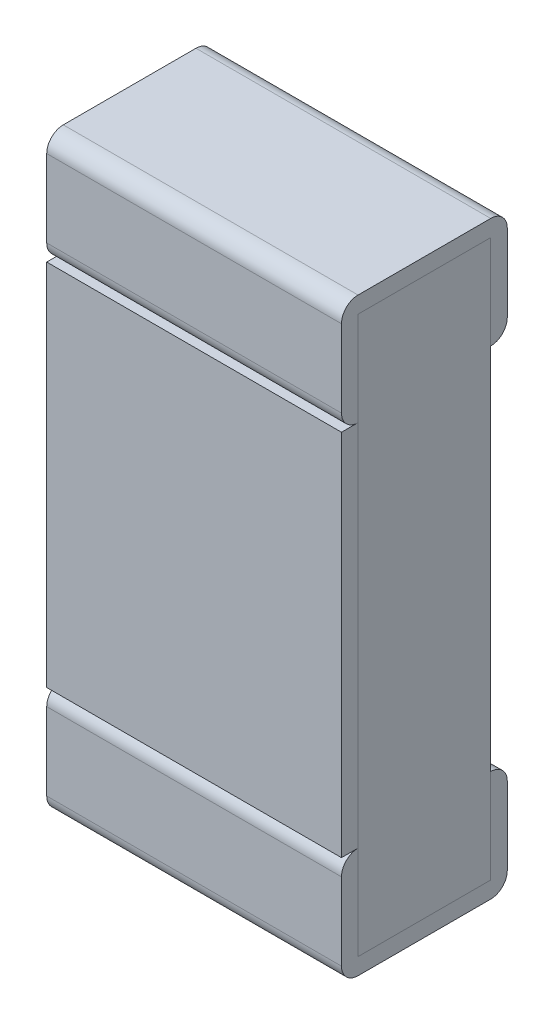
ISO-10303-21;
HEADER;
FILE_DESCRIPTION(('STEP AP214'),'2;1');
FILE_NAME('part.step','',(''),(''),'','','');
FILE_SCHEMA(('AUTOMOTIVE_DESIGN { 1 0 10303 214 1 1 1 1 }'));
ENDSEC;
DATA;
#1=APPLICATION_CONTEXT('core data for automotive mechanical design processes');
#2=APPLICATION_PROTOCOL_DEFINITION('international standard','automotive_design',2000,#1);
#3=PRODUCT_CONTEXT('',#1,'mechanical');
#4=PRODUCT('Part','Part','',(#3));
#5=PRODUCT_RELATED_PRODUCT_CATEGORY('part','',(#4));
#6=PRODUCT_DEFINITION_FORMATION('','',#4);
#7=PRODUCT_DEFINITION_CONTEXT('part definition',#1,'design');
#8=PRODUCT_DEFINITION('design','',#6,#7);
#9=PRODUCT_DEFINITION_SHAPE('','',#8);
#10=(LENGTH_UNIT() NAMED_UNIT(*) SI_UNIT(.MILLI.,.METRE.));
#11=(NAMED_UNIT(*) PLANE_ANGLE_UNIT() SI_UNIT($,.RADIAN.));
#12=(NAMED_UNIT(*) SI_UNIT($,.STERADIAN.) SOLID_ANGLE_UNIT());
#13=UNCERTAINTY_MEASURE_WITH_UNIT(LENGTH_MEASURE(1.E-05),#10,'distance_accuracy_value','');
#14=(GEOMETRIC_REPRESENTATION_CONTEXT(3) GLOBAL_UNCERTAINTY_ASSIGNED_CONTEXT((#13)) GLOBAL_UNIT_ASSIGNED_CONTEXT((#10,
#11,#12)) REPRESENTATION_CONTEXT('',''));
#15=CARTESIAN_POINT('',(0.,0.,0.));
#16=DIRECTION('',(0.,0.,1.));
#17=DIRECTION('',(1.,0.,0.));
#18=AXIS2_PLACEMENT_3D('',#15,#16,#17);
#19=CARTESIAN_POINT('',(119.258744279938,105.59404329235,142.661582908599));
#20=DIRECTION('',(0.,0.,1.));
#21=DIRECTION('',(1.,0.,0.));
#22=AXIS2_PLACEMENT_3D('',#19,#20,#21);
#23=PLANE('',#22);
#24=DIRECTION('',(-1.,0.,0.));
#25=VECTOR('',#24,1.);
#26=CARTESIAN_POINT('',(119.258744279938,105.59404329235,142.661582908599));
#27=LINE('',#26,#25);
#28=CARTESIAN_POINT('',(119.258744279938,105.59404329235,142.661582908599));
#29=VERTEX_POINT('',#28);
#30=CARTESIAN_POINT('',(118.458744279938,105.59404329235,142.661582908599));
#31=VERTEX_POINT('',#30);
#32=EDGE_CURVE('E67',#29,#31,#27,.T.);
#33=ORIENTED_EDGE('',*,*,#32,.F.);
#34=DIRECTION('',(0.,1.,0.));
#35=VECTOR('',#34,1.);
#36=CARTESIAN_POINT('',(119.258744279938,105.59404329235,142.661582908599));
#37=LINE('',#36,#35);
#38=CARTESIAN_POINT('',(119.258744279938,106.59404329235,142.661582908599));
#39=VERTEX_POINT('',#38);
#40=EDGE_CURVE('E11',#29,#39,#37,.T.);
#41=ORIENTED_EDGE('',*,*,#40,.T.);
#42=DIRECTION('',(-1.,0.,0.));
#43=VECTOR('',#42,1.);
#44=CARTESIAN_POINT('',(119.258744279938,106.59404329235,142.661582908599));
#45=LINE('',#44,#43);
#46=CARTESIAN_POINT('',(118.458744279938,106.59404329235,142.661582908599));
#47=VERTEX_POINT('',#46);
#48=EDGE_CURVE('E55',#39,#47,#45,.T.);
#49=ORIENTED_EDGE('',*,*,#48,.T.);
#50=DIRECTION('',(0.,1.,0.));
#51=VECTOR('',#50,1.);
#52=CARTESIAN_POINT('',(118.458744279938,105.59404329235,142.661582908599));
#53=LINE('',#52,#51);
#54=EDGE_CURVE('E275',#31,#47,#53,.T.);
#55=ORIENTED_EDGE('',*,*,#54,.F.);
#56=EDGE_LOOP('',(#33,#41,#49,#55));
#57=FACE_BOUND('',#56,.T.);
#58=ADVANCED_FACE('F44',(#57),#23,.T.);
#59=CARTESIAN_POINT('',(119.258744279938,106.59404329235,142.616582908599));
#60=DIRECTION('',(0.,1.,0.));
#61=DIRECTION('',(1.,0.,0.));
#62=AXIS2_PLACEMENT_3D('',#59,#60,#61);
#63=PLANE('',#62);
#64=DIRECTION('',(0.,0.,1.));
#65=VECTOR('',#64,1.);
#66=CARTESIAN_POINT('',(119.258744279938,106.59404329235,142.616582908599));
#67=LINE('',#66,#65);
#68=CARTESIAN_POINT('',(119.258744279938,106.59404329235,142.616582908599));
#69=VERTEX_POINT('',#68);
#70=EDGE_CURVE('E294',#69,#39,#67,.T.);
#71=ORIENTED_EDGE('',*,*,#70,.F.);
#72=DIRECTION('',(-1.,0.,0.));
#73=VECTOR('',#72,1.);
#74=CARTESIAN_POINT('',(119.258744279938,106.59404329235,142.616582908599));
#75=LINE('',#74,#73);
#76=CARTESIAN_POINT('',(118.458744279938,106.59404329235,142.616582908599));
#77=VERTEX_POINT('',#76);
#78=EDGE_CURVE('E371',#69,#77,#75,.T.);
#79=ORIENTED_EDGE('',*,*,#78,.T.);
#80=DIRECTION('',(0.,0.,1.));
#81=VECTOR('',#80,1.);
#82=CARTESIAN_POINT('',(118.458744279938,106.59404329235,142.616582908599));
#83=LINE('',#82,#81);
#84=EDGE_CURVE('E408',#77,#47,#83,.T.);
#85=ORIENTED_EDGE('',*,*,#84,.T.);
#86=ORIENTED_EDGE('',*,*,#48,.F.);
#87=EDGE_LOOP('',(#71,#79,#85,#86));
#88=FACE_BOUND('',#87,.T.);
#89=ADVANCED_FACE('F548',(#88),#63,.T.);
#90=CARTESIAN_POINT('',(119.258744279938,106.63904329235,142.616582908599));
#91=DIRECTION('',(-1.,0.,0.));
#92=DIRECTION('',(0.,-1.,0.));
#93=AXIS2_PLACEMENT_3D('',#90,#91,#92);
#94=CYLINDRICAL_SURFACE('',#93,0.0450000000000034);
#95=CARTESIAN_POINT('',(119.258744279938,106.63904329235,142.616582908599));
#96=DIRECTION('',(-1.,0.,0.));
#97=DIRECTION('',(0.,0.,1.));
#98=AXIS2_PLACEMENT_3D('',#95,#96,#97);
#99=CIRCLE('',#98,0.0449999999999895);
#100=CARTESIAN_POINT('',(119.258744279938,106.63904329235,142.661582908599));
#101=VERTEX_POINT('',#100);
#102=EDGE_CURVE('E401',#69,#101,#99,.T.);
#103=ORIENTED_EDGE('',*,*,#102,.T.);
#104=DIRECTION('',(-1.,0.,0.));
#105=VECTOR('',#104,1.);
#106=CARTESIAN_POINT('',(119.258744279938,106.63904329235,142.661582908599));
#107=LINE('',#106,#105);
#108=CARTESIAN_POINT('',(118.458744279938,106.63904329235,142.661582908599));
#109=VERTEX_POINT('',#108);
#110=EDGE_CURVE('E361',#101,#109,#107,.T.);
#111=ORIENTED_EDGE('',*,*,#110,.T.);
#112=CARTESIAN_POINT('',(118.458744279938,106.63904329235,142.616582908599));
#113=DIRECTION('',(-1.,0.,0.));
#114=DIRECTION('',(0.,0.,1.));
#115=AXIS2_PLACEMENT_3D('',#112,#113,#114);
#116=CIRCLE('',#115,0.0449999999999895);
#117=EDGE_CURVE('E316',#77,#109,#116,.T.);
#118=ORIENTED_EDGE('',*,*,#117,.F.);
#119=ORIENTED_EDGE('',*,*,#78,.F.);
#120=EDGE_LOOP('',(#103,#111,#118,#119));
#121=FACE_BOUND('',#120,.T.);
#122=ADVANCED_FACE('F596',(#121),#94,.T.);
#123=CARTESIAN_POINT('',(119.258744279938,106.59404329235,142.661582908599));
#124=DIRECTION('',(0.,0.,1.));
#125=DIRECTION('',(1.,0.,0.));
#126=AXIS2_PLACEMENT_3D('',#123,#124,#125);
#127=PLANE('',#126);
#128=DIRECTION('',(0.,1.,0.));
#129=VECTOR('',#128,1.);
#130=CARTESIAN_POINT('',(118.458744279938,106.59404329235,142.661582908599));
#131=LINE('',#130,#129);
#132=CARTESIAN_POINT('',(118.458744279938,106.84904329235,142.661582908599));
#133=VERTEX_POINT('',#132);
#134=EDGE_CURVE('E319',#109,#133,#131,.T.);
#135=ORIENTED_EDGE('',*,*,#134,.F.);
#136=ORIENTED_EDGE('',*,*,#110,.F.);
#137=DIRECTION('',(0.,1.,0.));
#138=VECTOR('',#137,1.);
#139=CARTESIAN_POINT('',(119.258744279938,106.59404329235,142.661582908599));
#140=LINE('',#139,#138);
#141=CARTESIAN_POINT('',(119.258744279938,106.84904329235,142.661582908599));
#142=VERTEX_POINT('',#141);
#143=EDGE_CURVE('E357',#101,#142,#140,.T.);
#144=ORIENTED_EDGE('',*,*,#143,.T.);
#145=DIRECTION('',(-1.,0.,0.));
#146=VECTOR('',#145,1.);
#147=CARTESIAN_POINT('',(119.258744279938,106.84904329235,142.661582908599));
#148=LINE('',#147,#146);
#149=EDGE_CURVE('E362',#142,#133,#148,.T.);
#150=ORIENTED_EDGE('',*,*,#149,.T.);
#151=EDGE_LOOP('',(#135,#136,#144,#150));
#152=FACE_BOUND('',#151,.T.);
#153=ADVANCED_FACE('F607',(#152),#127,.T.);
#154=CARTESIAN_POINT('',(119.258744279938,106.84904329235,142.616582908599));
#155=DIRECTION('',(-1.,0.,0.));
#156=DIRECTION('',(0.,1.,0.));
#157=AXIS2_PLACEMENT_3D('',#154,#155,#156);
#158=CYLINDRICAL_SURFACE('',#157,0.0450000000000034);
#159=DIRECTION('',(-1.,0.,0.));
#160=VECTOR('',#159,1.);
#161=CARTESIAN_POINT('',(119.258744279938,106.89404329235,142.616582908599));
#162=LINE('',#161,#160);
#163=CARTESIAN_POINT('',(119.258744279938,106.89404329235,142.616582908599));
#164=VERTEX_POINT('',#163);
#165=CARTESIAN_POINT('',(118.458744279938,106.89404329235,142.616582908599));
#166=VERTEX_POINT('',#165);
#167=EDGE_CURVE('E412',#164,#166,#162,.T.);
#168=ORIENTED_EDGE('',*,*,#167,.T.);
#169=CARTESIAN_POINT('',(118.458744279938,106.84904329235,142.616582908599));
#170=DIRECTION('',(1.,0.,0.));
#171=DIRECTION('',(0.,0.,1.));
#172=AXIS2_PLACEMENT_3D('',#169,#170,#171);
#173=CIRCLE('',#172,0.0449999999999895);
#174=EDGE_CURVE('E303',#166,#133,#173,.T.);
#175=ORIENTED_EDGE('',*,*,#174,.T.);
#176=ORIENTED_EDGE('',*,*,#149,.F.);
#177=CARTESIAN_POINT('',(119.258744279938,106.84904329235,142.616582908599));
#178=DIRECTION('',(1.,0.,0.));
#179=DIRECTION('',(0.,0.,1.));
#180=AXIS2_PLACEMENT_3D('',#177,#178,#179);
#181=CIRCLE('',#180,0.0449999999999895);
#182=EDGE_CURVE('E380',#164,#142,#181,.T.);
#183=ORIENTED_EDGE('',*,*,#182,.F.);
#184=EDGE_LOOP('',(#168,#175,#176,#183));
#185=FACE_BOUND('',#184,.T.);
#186=ADVANCED_FACE('F587',(#185),#158,.T.);
#187=CARTESIAN_POINT('',(119.258744279938,106.89404329235,142.211582908599));
#188=DIRECTION('',(0.,1.,0.));
#189=DIRECTION('',(1.,0.,0.));
#190=AXIS2_PLACEMENT_3D('',#187,#188,#189);
#191=PLANE('',#190);
#192=DIRECTION('',(0.,0.,1.));
#193=VECTOR('',#192,1.);
#194=CARTESIAN_POINT('',(119.258744279938,106.89404329235,142.211582908599));
#195=LINE('',#194,#193);
#196=CARTESIAN_POINT('',(119.258744279938,106.89404329235,142.256582908599));
#197=VERTEX_POINT('',#196);
#198=EDGE_CURVE('E433',#197,#164,#195,.T.);
#199=ORIENTED_EDGE('',*,*,#198,.F.);
#200=DIRECTION('',(-1.,0.,0.));
#201=VECTOR('',#200,1.);
#202=CARTESIAN_POINT('',(119.258744279938,106.89404329235,142.256582908599));
#203=LINE('',#202,#201);
#204=CARTESIAN_POINT('',(118.458744279938,106.89404329235,142.256582908599));
#205=VERTEX_POINT('',#204);
#206=EDGE_CURVE('E300',#197,#205,#203,.T.);
#207=ORIENTED_EDGE('',*,*,#206,.T.);
#208=DIRECTION('',(0.,0.,1.));
#209=VECTOR('',#208,1.);
#210=CARTESIAN_POINT('',(118.458744279938,106.89404329235,142.211582908599));
#211=LINE('',#210,#209);
#212=EDGE_CURVE('E304',#205,#166,#211,.T.);
#213=ORIENTED_EDGE('',*,*,#212,.T.);
#214=ORIENTED_EDGE('',*,*,#167,.F.);
#215=EDGE_LOOP('',(#199,#207,#213,#214));
#216=FACE_BOUND('',#215,.T.);
#217=ADVANCED_FACE('F577',(#216),#191,.T.);
#218=CARTESIAN_POINT('',(119.258744279938,106.84904329235,142.256582908599));
#219=DIRECTION('',(-1.,0.,0.));
#220=DIRECTION('',(0.,1.,0.));
#221=AXIS2_PLACEMENT_3D('',#218,#219,#220);
#222=CYLINDRICAL_SURFACE('',#221,0.0450000000000034);
#223=CARTESIAN_POINT('',(119.258744279938,106.84904329235,142.256582908599));
#224=DIRECTION('',(-1.,0.,0.));
#225=DIRECTION('',(0.,0.,1.));
#226=AXIS2_PLACEMENT_3D('',#223,#224,#225);
#227=CIRCLE('',#226,0.0449999999999895);
#228=CARTESIAN_POINT('',(119.258744279938,106.84904329235,142.211582908599));
#229=VERTEX_POINT('',#228);
#230=EDGE_CURVE('E252',#197,#229,#227,.T.);
#231=ORIENTED_EDGE('',*,*,#230,.T.);
#232=DIRECTION('',(-1.,0.,0.));
#233=VECTOR('',#232,1.);
#234=CARTESIAN_POINT('',(119.258744279938,106.84904329235,142.211582908599));
#235=LINE('',#234,#233);
#236=CARTESIAN_POINT('',(118.458744279938,106.84904329235,142.211582908599));
#237=VERTEX_POINT('',#236);
#238=EDGE_CURVE('E248',#229,#237,#235,.T.);
#239=ORIENTED_EDGE('',*,*,#238,.T.);
#240=CARTESIAN_POINT('',(118.458744279938,106.84904329235,142.256582908599));
#241=DIRECTION('',(-1.,0.,0.));
#242=DIRECTION('',(0.,0.,1.));
#243=AXIS2_PLACEMENT_3D('',#240,#241,#242);
#244=CIRCLE('',#243,0.0449999999999895);
#245=EDGE_CURVE('E395',#205,#237,#244,.T.);
#246=ORIENTED_EDGE('',*,*,#245,.F.);
#247=ORIENTED_EDGE('',*,*,#206,.F.);
#248=EDGE_LOOP('',(#231,#239,#246,#247));
#249=FACE_BOUND('',#248,.T.);
#250=ADVANCED_FACE('F579',(#249),#222,.T.);
#251=CARTESIAN_POINT('',(119.258744279938,106.59404329235,142.211582908599));
#252=DIRECTION('',(0.,0.,1.));
#253=DIRECTION('',(1.,0.,0.));
#254=AXIS2_PLACEMENT_3D('',#251,#252,#253);
#255=PLANE('',#254);
#256=ORIENTED_EDGE('',*,*,#238,.F.);
#257=DIRECTION('',(0.,1.,0.));
#258=VECTOR('',#257,1.);
#259=CARTESIAN_POINT('',(119.258744279938,106.59404329235,142.211582908599));
#260=LINE('',#259,#258);
#261=CARTESIAN_POINT('',(119.258744279938,106.63904329235,142.211582908599));
#262=VERTEX_POINT('',#261);
#263=EDGE_CURVE('E243',#262,#229,#260,.T.);
#264=ORIENTED_EDGE('',*,*,#263,.F.);
#265=DIRECTION('',(-1.,0.,0.));
#266=VECTOR('',#265,1.);
#267=CARTESIAN_POINT('',(119.258744279938,106.63904329235,142.211582908599));
#268=LINE('',#267,#266);
#269=CARTESIAN_POINT('',(118.458744279938,106.63904329235,142.211582908599));
#270=VERTEX_POINT('',#269);
#271=EDGE_CURVE('E253',#262,#270,#268,.T.);
#272=ORIENTED_EDGE('',*,*,#271,.T.);
#273=DIRECTION('',(0.,1.,0.));
#274=VECTOR('',#273,1.);
#275=CARTESIAN_POINT('',(118.458744279938,106.59404329235,142.211582908599));
#276=LINE('',#275,#274);
#277=EDGE_CURVE('E293',#270,#237,#276,.T.);
#278=ORIENTED_EDGE('',*,*,#277,.T.);
#279=EDGE_LOOP('',(#256,#264,#272,#278));
#280=FACE_BOUND('',#279,.T.);
#281=ADVANCED_FACE('F459',(#280),#255,.F.);
#282=CARTESIAN_POINT('',(119.258744279938,106.63904329235,142.256582908599));
#283=DIRECTION('',(-1.,0.,0.));
#284=DIRECTION('',(0.,-1.,0.));
#285=AXIS2_PLACEMENT_3D('',#282,#283,#284);
#286=CYLINDRICAL_SURFACE('',#285,0.0450000000000034);
#287=DIRECTION('',(-1.,0.,0.));
#288=VECTOR('',#287,1.);
#289=CARTESIAN_POINT('',(119.258744279938,106.59404329235,142.256582908599));
#290=LINE('',#289,#288);
#291=CARTESIAN_POINT('',(119.258744279938,106.59404329235,142.256582908599));
#292=VERTEX_POINT('',#291);
#293=CARTESIAN_POINT('',(118.458744279938,106.59404329235,142.256582908599));
#294=VERTEX_POINT('',#293);
#295=EDGE_CURVE('E363',#292,#294,#290,.T.);
#296=ORIENTED_EDGE('',*,*,#295,.T.);
#297=CARTESIAN_POINT('',(118.458744279938,106.63904329235,142.256582908599));
#298=DIRECTION('',(1.,0.,0.));
#299=DIRECTION('',(0.,0.,1.));
#300=AXIS2_PLACEMENT_3D('',#297,#298,#299);
#301=CIRCLE('',#300,0.0449999999999895);
#302=EDGE_CURVE('E367',#294,#270,#301,.T.);
#303=ORIENTED_EDGE('',*,*,#302,.T.);
#304=ORIENTED_EDGE('',*,*,#271,.F.);
#305=CARTESIAN_POINT('',(119.258744279938,106.63904329235,142.256582908599));
#306=DIRECTION('',(1.,0.,0.));
#307=DIRECTION('',(0.,0.,1.));
#308=AXIS2_PLACEMENT_3D('',#305,#306,#307);
#309=CIRCLE('',#308,0.0449999999999895);
#310=EDGE_CURVE('E246',#292,#262,#309,.T.);
#311=ORIENTED_EDGE('',*,*,#310,.F.);
#312=EDGE_LOOP('',(#296,#303,#304,#311));
#313=FACE_BOUND('',#312,.T.);
#314=ADVANCED_FACE('F449',(#313),#286,.T.);
#315=CARTESIAN_POINT('',(118.458744279938,105.59404329235,142.616582908599));
#316=DIRECTION('',(-1.,0.,0.));
#317=DIRECTION('',(0.,0.,1.));
#318=AXIS2_PLACEMENT_3D('',#315,#316,#317);
#319=PLANE('',#318);
#320=DIRECTION('',(0.,1.,0.));
#321=VECTOR('',#320,1.);
#322=CARTESIAN_POINT('',(118.458744279938,105.59404329235,142.616582908599));
#323=LINE('',#322,#321);
#324=CARTESIAN_POINT('',(118.458744279938,105.59404329235,142.616582908599));
#325=VERTEX_POINT('',#324);
#326=EDGE_CURVE('E268',#325,#77,#323,.T.);
#327=ORIENTED_EDGE('',*,*,#326,.F.);
#328=DIRECTION('',(0.,0.,1.));
#329=VECTOR('',#328,1.);
#330=CARTESIAN_POINT('',(118.458744279938,105.59404329235,142.616582908599));
#331=LINE('',#330,#329);
#332=EDGE_CURVE('E315',#325,#31,#331,.T.);
#333=ORIENTED_EDGE('',*,*,#332,.T.);
#334=ORIENTED_EDGE('',*,*,#54,.T.);
#335=ORIENTED_EDGE('',*,*,#84,.F.);
#336=EDGE_LOOP('',(#327,#333,#334,#335));
#337=FACE_BOUND('',#336,.T.);
#338=ADVANCED_FACE('F539',(#337),#319,.T.);
#339=CARTESIAN_POINT('',(118.458744279938,106.59404329235,142.211582908599));
#340=DIRECTION('',(-1.,0.,0.));
#341=DIRECTION('',(0.,0.,1.));
#342=AXIS2_PLACEMENT_3D('',#339,#340,#341);
#343=PLANE('',#342);
#344=ORIENTED_EDGE('',*,*,#277,.F.);
#345=ORIENTED_EDGE('',*,*,#302,.F.);
#346=DIRECTION('',(0.,1.,0.));
#347=VECTOR('',#346,1.);
#348=CARTESIAN_POINT('',(118.458744279938,105.33904329235,142.256582908599));
#349=LINE('',#348,#347);
#350=CARTESIAN_POINT('',(118.458744279938,106.84904329235,142.256582908599));
#351=VERTEX_POINT('',#350);
#352=EDGE_CURVE('E272',#294,#351,#349,.T.);
#353=ORIENTED_EDGE('',*,*,#352,.T.);
#354=DIRECTION('',(0.,0.,1.));
#355=VECTOR('',#354,1.);
#356=CARTESIAN_POINT('',(118.458744279938,106.84904329235,142.256582908599));
#357=LINE('',#356,#355);
#358=CARTESIAN_POINT('',(118.458744279938,106.84904329235,142.616582908599));
#359=VERTEX_POINT('',#358);
#360=EDGE_CURVE('E276',#351,#359,#357,.T.);
#361=ORIENTED_EDGE('',*,*,#360,.T.);
#362=DIRECTION('',(0.,1.,0.));
#363=VECTOR('',#362,1.);
#364=CARTESIAN_POINT('',(118.458744279938,105.33904329235,142.616582908599));
#365=LINE('',#364,#363);
#366=EDGE_CURVE('E355',#77,#359,#365,.T.);
#367=ORIENTED_EDGE('',*,*,#366,.F.);
#368=ORIENTED_EDGE('',*,*,#117,.T.);
#369=ORIENTED_EDGE('',*,*,#134,.T.);
#370=ORIENTED_EDGE('',*,*,#174,.F.);
#371=ORIENTED_EDGE('',*,*,#212,.F.);
#372=ORIENTED_EDGE('',*,*,#245,.T.);
#373=EDGE_LOOP('',(#344,#345,#353,#361,#367,#368,#369,#370,#371,#372));
#374=FACE_BOUND('',#373,.T.);
#375=ADVANCED_FACE('F454',(#374),#343,.T.);
#376=CARTESIAN_POINT('',(119.258744279938,105.59404329235,142.616582908599));
#377=DIRECTION('',(0.,1.,0.));
#378=DIRECTION('',(1.,0.,0.));
#379=AXIS2_PLACEMENT_3D('',#376,#377,#378);
#380=PLANE('',#379);
#381=ORIENTED_EDGE('',*,*,#32,.T.);
#382=ORIENTED_EDGE('',*,*,#332,.F.);
#383=DIRECTION('',(-1.,0.,0.));
#384=VECTOR('',#383,1.);
#385=CARTESIAN_POINT('',(119.258744279938,105.59404329235,142.616582908599));
#386=LINE('',#385,#384);
#387=CARTESIAN_POINT('',(119.258744279938,105.59404329235,142.616582908599));
#388=VERTEX_POINT('',#387);
#389=EDGE_CURVE('E217',#388,#325,#386,.T.);
#390=ORIENTED_EDGE('',*,*,#389,.F.);
#391=DIRECTION('',(0.,0.,1.));
#392=VECTOR('',#391,1.);
#393=CARTESIAN_POINT('',(119.258744279938,105.59404329235,142.616582908599));
#394=LINE('',#393,#392);
#395=EDGE_CURVE('E298',#388,#29,#394,.T.);
#396=ORIENTED_EDGE('',*,*,#395,.T.);
#397=EDGE_LOOP('',(#381,#382,#390,#396));
#398=FACE_BOUND('',#397,.T.);
#399=ADVANCED_FACE('F535',(#398),#380,.F.);
#400=CARTESIAN_POINT('',(119.258744279938,105.59404329235,142.616582908599));
#401=DIRECTION('',(-1.,0.,0.));
#402=DIRECTION('',(0.,0.,1.));
#403=AXIS2_PLACEMENT_3D('',#400,#401,#402);
#404=PLANE('',#403);
#405=ORIENTED_EDGE('',*,*,#70,.T.);
#406=ORIENTED_EDGE('',*,*,#40,.F.);
#407=ORIENTED_EDGE('',*,*,#395,.F.);
#408=DIRECTION('',(0.,1.,0.));
#409=VECTOR('',#408,1.);
#410=CARTESIAN_POINT('',(119.258744279938,105.59404329235,142.616582908599));
#411=LINE('',#410,#409);
#412=EDGE_CURVE('E299',#388,#69,#411,.T.);
#413=ORIENTED_EDGE('',*,*,#412,.T.);
#414=EDGE_LOOP('',(#405,#406,#407,#413));
#415=FACE_BOUND('',#414,.T.);
#416=ADVANCED_FACE('F559',(#415),#404,.F.);
#417=CARTESIAN_POINT('',(119.258744279938,106.59404329235,142.211582908599));
#418=DIRECTION('',(-1.,0.,0.));
#419=DIRECTION('',(0.,0.,1.));
#420=AXIS2_PLACEMENT_3D('',#417,#418,#419);
#421=PLANE('',#420);
#422=ORIENTED_EDGE('',*,*,#230,.F.);
#423=ORIENTED_EDGE('',*,*,#198,.T.);
#424=ORIENTED_EDGE('',*,*,#182,.T.);
#425=ORIENTED_EDGE('',*,*,#143,.F.);
#426=ORIENTED_EDGE('',*,*,#102,.F.);
#427=DIRECTION('',(0.,1.,0.));
#428=VECTOR('',#427,1.);
#429=CARTESIAN_POINT('',(119.258744279938,105.33904329235,142.616582908599));
#430=LINE('',#429,#428);
#431=CARTESIAN_POINT('',(119.258744279938,106.84904329235,142.616582908599));
#432=VERTEX_POINT('',#431);
#433=EDGE_CURVE('E262',#69,#432,#430,.T.);
#434=ORIENTED_EDGE('',*,*,#433,.T.);
#435=DIRECTION('',(0.,0.,1.));
#436=VECTOR('',#435,1.);
#437=CARTESIAN_POINT('',(119.258744279938,106.84904329235,142.256582908599));
#438=LINE('',#437,#436);
#439=CARTESIAN_POINT('',(119.258744279938,106.84904329235,142.256582908599));
#440=VERTEX_POINT('',#439);
#441=EDGE_CURVE('E326',#440,#432,#438,.T.);
#442=ORIENTED_EDGE('',*,*,#441,.F.);
#443=DIRECTION('',(0.,1.,0.));
#444=VECTOR('',#443,1.);
#445=CARTESIAN_POINT('',(119.258744279938,105.33904329235,142.256582908599));
#446=LINE('',#445,#444);
#447=EDGE_CURVE('E48',#292,#440,#446,.T.);
#448=ORIENTED_EDGE('',*,*,#447,.F.);
#449=ORIENTED_EDGE('',*,*,#310,.T.);
#450=ORIENTED_EDGE('',*,*,#263,.T.);
#451=EDGE_LOOP('',(#422,#423,#424,#425,#426,#434,#442,#448,#449,#450));
#452=FACE_BOUND('',#451,.T.);
#453=ADVANCED_FACE('F464',(#452),#421,.F.);
#454=CARTESIAN_POINT('',(119.258744279938,105.33904329235,142.256582908599));
#455=DIRECTION('',(0.,0.,1.));
#456=DIRECTION('',(1.,0.,0.));
#457=AXIS2_PLACEMENT_3D('',#454,#455,#456);
#458=PLANE('',#457);
#459=DIRECTION('',(0.,1.,0.));
#460=VECTOR('',#459,1.);
#461=CARTESIAN_POINT('',(118.458744279938,105.33904329235,142.256582908599));
#462=LINE('',#461,#460);
#463=CARTESIAN_POINT('',(118.458744279938,105.59404329235,142.256582908599));
#464=VERTEX_POINT('',#463);
#465=EDGE_CURVE('E247',#464,#294,#462,.T.);
#466=ORIENTED_EDGE('',*,*,#465,.T.);
#467=ORIENTED_EDGE('',*,*,#295,.F.);
#468=DIRECTION('',(0.,1.,0.));
#469=VECTOR('',#468,1.);
#470=CARTESIAN_POINT('',(119.258744279938,105.33904329235,142.256582908599));
#471=LINE('',#470,#469);
#472=CARTESIAN_POINT('',(119.258744279938,105.59404329235,142.256582908599));
#473=VERTEX_POINT('',#472);
#474=EDGE_CURVE('E211',#473,#292,#471,.T.);
#475=ORIENTED_EDGE('',*,*,#474,.F.);
#476=DIRECTION('',(-1.,0.,0.));
#477=VECTOR('',#476,1.);
#478=CARTESIAN_POINT('',(119.258744279938,105.59404329235,142.256582908599));
#479=LINE('',#478,#477);
#480=EDGE_CURVE('E381',#473,#464,#479,.T.);
#481=ORIENTED_EDGE('',*,*,#480,.T.);
#482=EDGE_LOOP('',(#466,#467,#475,#481));
#483=FACE_BOUND('',#482,.T.);
#484=ADVANCED_FACE('F469',(#483),#458,.F.);
#485=CARTESIAN_POINT('',(118.458744279938,105.33904329235,142.256582908599));
#486=DIRECTION('',(-1.,0.,0.));
#487=DIRECTION('',(0.,0.,1.));
#488=AXIS2_PLACEMENT_3D('',#485,#486,#487);
#489=PLANE('',#488);
#490=DIRECTION('',(0.,1.,0.));
#491=VECTOR('',#490,1.);
#492=CARTESIAN_POINT('',(118.458744279938,105.33904329235,142.256582908599));
#493=LINE('',#492,#491);
#494=CARTESIAN_POINT('',(118.458744279938,105.33904329235,142.256582908599));
#495=VERTEX_POINT('',#494);
#496=EDGE_CURVE('E227',#495,#464,#493,.T.);
#497=ORIENTED_EDGE('',*,*,#496,.F.);
#498=DIRECTION('',(0.,0.,1.));
#499=VECTOR('',#498,1.);
#500=CARTESIAN_POINT('',(118.458744279938,105.33904329235,142.256582908599));
#501=LINE('',#500,#499);
#502=CARTESIAN_POINT('',(118.458744279938,105.33904329235,142.616582908599));
#503=VERTEX_POINT('',#502);
#504=EDGE_CURVE('E267',#495,#503,#501,.T.);
#505=ORIENTED_EDGE('',*,*,#504,.T.);
#506=DIRECTION('',(0.,1.,0.));
#507=VECTOR('',#506,1.);
#508=CARTESIAN_POINT('',(118.458744279938,105.33904329235,142.616582908599));
#509=LINE('',#508,#507);
#510=EDGE_CURVE('E263',#503,#325,#509,.T.);
#511=ORIENTED_EDGE('',*,*,#510,.T.);
#512=ORIENTED_EDGE('',*,*,#326,.T.);
#513=ORIENTED_EDGE('',*,*,#366,.T.);
#514=ORIENTED_EDGE('',*,*,#360,.F.);
#515=ORIENTED_EDGE('',*,*,#352,.F.);
#516=ORIENTED_EDGE('',*,*,#465,.F.);
#517=EDGE_LOOP('',(#497,#505,#511,#512,#513,#514,#515,#516));
#518=FACE_BOUND('',#517,.T.);
#519=ADVANCED_FACE('F511',(#518),#489,.T.);
#520=CARTESIAN_POINT('',(119.258744279938,105.54904329235,142.616582908599));
#521=DIRECTION('',(-1.,0.,0.));
#522=DIRECTION('',(0.,1.,0.));
#523=AXIS2_PLACEMENT_3D('',#520,#521,#522);
#524=CYLINDRICAL_SURFACE('',#523,0.0450000000000034);
#525=ORIENTED_EDGE('',*,*,#389,.T.);
#526=CARTESIAN_POINT('',(118.458744279938,105.54904329235,142.616582908599));
#527=DIRECTION('',(1.,0.,0.));
#528=DIRECTION('',(0.,0.,1.));
#529=AXIS2_PLACEMENT_3D('',#526,#527,#528);
#530=CIRCLE('',#529,0.0449999999999895);
#531=CARTESIAN_POINT('',(118.458744279938,105.54904329235,142.661582908599));
#532=VERTEX_POINT('',#531);
#533=EDGE_CURVE('E214',#325,#532,#530,.T.);
#534=ORIENTED_EDGE('',*,*,#533,.T.);
#535=DIRECTION('',(-1.,0.,0.));
#536=VECTOR('',#535,1.);
#537=CARTESIAN_POINT('',(119.258744279938,105.54904329235,142.661582908599));
#538=LINE('',#537,#536);
#539=CARTESIAN_POINT('',(119.258744279938,105.54904329235,142.661582908599));
#540=VERTEX_POINT('',#539);
#541=EDGE_CURVE('E199',#540,#532,#538,.T.);
#542=ORIENTED_EDGE('',*,*,#541,.F.);
#543=CARTESIAN_POINT('',(119.258744279938,105.54904329235,142.616582908599));
#544=DIRECTION('',(1.,0.,0.));
#545=DIRECTION('',(0.,0.,1.));
#546=AXIS2_PLACEMENT_3D('',#543,#544,#545);
#547=CIRCLE('',#546,0.0449999999999895);
#548=EDGE_CURVE('E281',#388,#540,#547,.T.);
#549=ORIENTED_EDGE('',*,*,#548,.F.);
#550=EDGE_LOOP('',(#525,#534,#542,#549));
#551=FACE_BOUND('',#550,.T.);
#552=ADVANCED_FACE('F215',(#551),#524,.T.);
#553=CARTESIAN_POINT('',(119.258744279938,105.29404329235,142.661582908599));
#554=DIRECTION('',(0.,0.,1.));
#555=DIRECTION('',(1.,0.,0.));
#556=AXIS2_PLACEMENT_3D('',#553,#554,#555);
#557=PLANE('',#556);
#558=DIRECTION('',(0.,1.,0.));
#559=VECTOR('',#558,1.);
#560=CARTESIAN_POINT('',(118.458744279938,105.29404329235,142.661582908599));
#561=LINE('',#560,#559);
#562=CARTESIAN_POINT('',(118.458744279938,105.33904329235,142.661582908599));
#563=VERTEX_POINT('',#562);
#564=EDGE_CURVE('E204',#563,#532,#561,.T.);
#565=ORIENTED_EDGE('',*,*,#564,.F.);
#566=DIRECTION('',(-1.,0.,0.));
#567=VECTOR('',#566,1.);
#568=CARTESIAN_POINT('',(119.258744279938,105.33904329235,142.661582908599));
#569=LINE('',#568,#567);
#570=CARTESIAN_POINT('',(119.258744279938,105.33904329235,142.661582908599));
#571=VERTEX_POINT('',#570);
#572=EDGE_CURVE('E394',#571,#563,#569,.T.);
#573=ORIENTED_EDGE('',*,*,#572,.F.);
#574=DIRECTION('',(0.,1.,0.));
#575=VECTOR('',#574,1.);
#576=CARTESIAN_POINT('',(119.258744279938,105.29404329235,142.661582908599));
#577=LINE('',#576,#575);
#578=EDGE_CURVE('E207',#571,#540,#577,.T.);
#579=ORIENTED_EDGE('',*,*,#578,.T.);
#580=ORIENTED_EDGE('',*,*,#541,.T.);
#581=EDGE_LOOP('',(#565,#573,#579,#580));
#582=FACE_BOUND('',#581,.T.);
#583=ADVANCED_FACE('F201',(#582),#557,.T.);
#584=CARTESIAN_POINT('',(119.258744279938,105.33904329235,142.256582908599));
#585=DIRECTION('',(-1.,0.,0.));
#586=DIRECTION('',(0.,0.,1.));
#587=AXIS2_PLACEMENT_3D('',#584,#585,#586);
#588=PLANE('',#587);
#589=ORIENTED_EDGE('',*,*,#474,.T.);
#590=ORIENTED_EDGE('',*,*,#447,.T.);
#591=ORIENTED_EDGE('',*,*,#441,.T.);
#592=ORIENTED_EDGE('',*,*,#433,.F.);
#593=ORIENTED_EDGE('',*,*,#412,.F.);
#594=DIRECTION('',(0.,1.,0.));
#595=VECTOR('',#594,1.);
#596=CARTESIAN_POINT('',(119.258744279938,105.33904329235,142.616582908599));
#597=LINE('',#596,#595);
#598=CARTESIAN_POINT('',(119.258744279938,105.33904329235,142.616582908599));
#599=VERTEX_POINT('',#598);
#600=EDGE_CURVE('E285',#599,#388,#597,.T.);
#601=ORIENTED_EDGE('',*,*,#600,.F.);
#602=DIRECTION('',(0.,0.,1.));
#603=VECTOR('',#602,1.);
#604=CARTESIAN_POINT('',(119.258744279938,105.33904329235,142.256582908599));
#605=LINE('',#604,#603);
#606=CARTESIAN_POINT('',(119.258744279938,105.33904329235,142.256582908599));
#607=VERTEX_POINT('',#606);
#608=EDGE_CURVE('E329',#607,#599,#605,.T.);
#609=ORIENTED_EDGE('',*,*,#608,.F.);
#610=DIRECTION('',(0.,1.,0.));
#611=VECTOR('',#610,1.);
#612=CARTESIAN_POINT('',(119.258744279938,105.33904329235,142.256582908599));
#613=LINE('',#612,#611);
#614=EDGE_CURVE('E310',#607,#473,#613,.T.);
#615=ORIENTED_EDGE('',*,*,#614,.T.);
#616=EDGE_LOOP('',(#589,#590,#591,#592,#593,#601,#609,#615));
#617=FACE_BOUND('',#616,.T.);
#618=ADVANCED_FACE('F473',(#617),#588,.F.);
#619=CARTESIAN_POINT('',(119.258744279938,105.54904329235,142.256582908599));
#620=DIRECTION('',(-1.,0.,0.));
#621=DIRECTION('',(0.,1.,0.));
#622=AXIS2_PLACEMENT_3D('',#619,#620,#621);
#623=CYLINDRICAL_SURFACE('',#622,0.0450000000000034);
#624=CARTESIAN_POINT('',(119.258744279938,105.54904329235,142.256582908599));
#625=DIRECTION('',(-1.,0.,0.));
#626=DIRECTION('',(0.,0.,1.));
#627=AXIS2_PLACEMENT_3D('',#624,#625,#626);
#628=CIRCLE('',#627,0.0449999999999895);
#629=CARTESIAN_POINT('',(119.258744279938,105.54904329235,142.211582908599));
#630=VERTEX_POINT('',#629);
#631=EDGE_CURVE('E306',#473,#630,#628,.T.);
#632=ORIENTED_EDGE('',*,*,#631,.T.);
#633=DIRECTION('',(-1.,0.,0.));
#634=VECTOR('',#633,1.);
#635=CARTESIAN_POINT('',(119.258744279938,105.54904329235,142.211582908599));
#636=LINE('',#635,#634);
#637=CARTESIAN_POINT('',(118.458744279938,105.54904329235,142.211582908599));
#638=VERTEX_POINT('',#637);
#639=EDGE_CURVE('E311',#630,#638,#636,.T.);
#640=ORIENTED_EDGE('',*,*,#639,.T.);
#641=CARTESIAN_POINT('',(118.458744279938,105.54904329235,142.256582908599));
#642=DIRECTION('',(-1.,0.,0.));
#643=DIRECTION('',(0.,0.,1.));
#644=AXIS2_PLACEMENT_3D('',#641,#642,#643);
#645=CIRCLE('',#644,0.0449999999999895);
#646=EDGE_CURVE('E237',#464,#638,#645,.T.);
#647=ORIENTED_EDGE('',*,*,#646,.F.);
#648=ORIENTED_EDGE('',*,*,#480,.F.);
#649=EDGE_LOOP('',(#632,#640,#647,#648));
#650=FACE_BOUND('',#649,.T.);
#651=ADVANCED_FACE('F507',(#650),#623,.T.);
#652=CARTESIAN_POINT('',(119.258744279938,105.29404329235,142.211582908599));
#653=DIRECTION('',(0.,0.,1.));
#654=DIRECTION('',(1.,0.,0.));
#655=AXIS2_PLACEMENT_3D('',#652,#653,#654);
#656=PLANE('',#655);
#657=ORIENTED_EDGE('',*,*,#639,.F.);
#658=DIRECTION('',(0.,1.,0.));
#659=VECTOR('',#658,1.);
#660=CARTESIAN_POINT('',(119.258744279938,105.29404329235,142.211582908599));
#661=LINE('',#660,#659);
#662=CARTESIAN_POINT('',(119.258744279938,105.33904329235,142.211582908599));
#663=VERTEX_POINT('',#662);
#664=EDGE_CURVE('E282',#663,#630,#661,.T.);
#665=ORIENTED_EDGE('',*,*,#664,.F.);
#666=DIRECTION('',(-1.,0.,0.));
#667=VECTOR('',#666,1.);
#668=CARTESIAN_POINT('',(119.258744279938,105.33904329235,142.211582908599));
#669=LINE('',#668,#667);
#670=CARTESIAN_POINT('',(118.458744279938,105.33904329235,142.211582908599));
#671=VERTEX_POINT('',#670);
#672=EDGE_CURVE('E258',#663,#671,#669,.T.);
#673=ORIENTED_EDGE('',*,*,#672,.T.);
#674=DIRECTION('',(0.,1.,0.));
#675=VECTOR('',#674,1.);
#676=CARTESIAN_POINT('',(118.458744279938,105.29404329235,142.211582908599));
#677=LINE('',#676,#675);
#678=EDGE_CURVE('E254',#671,#638,#677,.T.);
#679=ORIENTED_EDGE('',*,*,#678,.T.);
#680=EDGE_LOOP('',(#657,#665,#673,#679));
#681=FACE_BOUND('',#680,.T.);
#682=ADVANCED_FACE('F504',(#681),#656,.F.);
#683=CARTESIAN_POINT('',(118.458744279938,105.29404329235,142.211582908599));
#684=DIRECTION('',(-1.,0.,0.));
#685=DIRECTION('',(0.,0.,1.));
#686=AXIS2_PLACEMENT_3D('',#683,#684,#685);
#687=PLANE('',#686);
#688=ORIENTED_EDGE('',*,*,#678,.F.);
#689=CARTESIAN_POINT('',(118.458744279938,105.33904329235,142.256582908599));
#690=DIRECTION('',(1.,0.,0.));
#691=DIRECTION('',(0.,0.,1.));
#692=AXIS2_PLACEMENT_3D('',#689,#690,#691);
#693=CIRCLE('',#692,0.0449999999999895);
#694=CARTESIAN_POINT('',(118.458744279938,105.29404329235,142.256582908599));
#695=VERTEX_POINT('',#694);
#696=EDGE_CURVE('E332',#695,#671,#693,.T.);
#697=ORIENTED_EDGE('',*,*,#696,.F.);
#698=DIRECTION('',(0.,0.,1.));
#699=VECTOR('',#698,1.);
#700=CARTESIAN_POINT('',(118.458744279938,105.29404329235,142.211582908599));
#701=LINE('',#700,#699);
#702=CARTESIAN_POINT('',(118.458744279938,105.29404329235,142.616582908599));
#703=VERTEX_POINT('',#702);
#704=EDGE_CURVE('E233',#695,#703,#701,.T.);
#705=ORIENTED_EDGE('',*,*,#704,.T.);
#706=CARTESIAN_POINT('',(118.458744279938,105.33904329235,142.616582908599));
#707=DIRECTION('',(-1.,0.,0.));
#708=DIRECTION('',(0.,0.,1.));
#709=AXIS2_PLACEMENT_3D('',#706,#707,#708);
#710=CIRCLE('',#709,0.0449999999999895);
#711=EDGE_CURVE('E225',#703,#563,#710,.T.);
#712=ORIENTED_EDGE('',*,*,#711,.T.);
#713=ORIENTED_EDGE('',*,*,#564,.T.);
#714=ORIENTED_EDGE('',*,*,#533,.F.);
#715=ORIENTED_EDGE('',*,*,#510,.F.);
#716=ORIENTED_EDGE('',*,*,#504,.F.);
#717=ORIENTED_EDGE('',*,*,#496,.T.);
#718=ORIENTED_EDGE('',*,*,#646,.T.);
#719=EDGE_LOOP('',(#688,#697,#705,#712,#713,#714,#715,#716,#717,#718));
#720=FACE_BOUND('',#719,.T.);
#721=ADVANCED_FACE('F223',(#720),#687,.T.);
#722=CARTESIAN_POINT('',(119.258744279938,105.33904329235,142.616582908599));
#723=DIRECTION('',(-1.,0.,0.));
#724=DIRECTION('',(0.,-1.,0.));
#725=AXIS2_PLACEMENT_3D('',#722,#723,#724);
#726=CYLINDRICAL_SURFACE('',#725,0.0450000000000034);
#727=CARTESIAN_POINT('',(119.258744279938,105.33904329235,142.616582908599));
#728=DIRECTION('',(-1.,0.,0.));
#729=DIRECTION('',(0.,0.,1.));
#730=AXIS2_PLACEMENT_3D('',#727,#728,#729);
#731=CIRCLE('',#730,0.0449999999999895);
#732=CARTESIAN_POINT('',(119.258744279938,105.29404329235,142.616582908599));
#733=VERTEX_POINT('',#732);
#734=EDGE_CURVE('E386',#733,#571,#731,.T.);
#735=ORIENTED_EDGE('',*,*,#734,.T.);
#736=ORIENTED_EDGE('',*,*,#572,.T.);
#737=ORIENTED_EDGE('',*,*,#711,.F.);
#738=DIRECTION('',(-1.,0.,0.));
#739=VECTOR('',#738,1.);
#740=CARTESIAN_POINT('',(119.258744279938,105.29404329235,142.616582908599));
#741=LINE('',#740,#739);
#742=EDGE_CURVE('E289',#733,#703,#741,.T.);
#743=ORIENTED_EDGE('',*,*,#742,.F.);
#744=EDGE_LOOP('',(#735,#736,#737,#743));
#745=FACE_BOUND('',#744,.T.);
#746=ADVANCED_FACE('F492',(#745),#726,.T.);
#747=CARTESIAN_POINT('',(119.258744279938,105.33904329235,142.256582908599));
#748=DIRECTION('',(-1.,0.,0.));
#749=DIRECTION('',(0.,-1.,0.));
#750=AXIS2_PLACEMENT_3D('',#747,#748,#749);
#751=CYLINDRICAL_SURFACE('',#750,0.0450000000000034);
#752=DIRECTION('',(-1.,0.,0.));
#753=VECTOR('',#752,1.);
#754=CARTESIAN_POINT('',(119.258744279938,105.29404329235,142.256582908599));
#755=LINE('',#754,#753);
#756=CARTESIAN_POINT('',(119.258744279938,105.29404329235,142.256582908599));
#757=VERTEX_POINT('',#756);
#758=EDGE_CURVE('E342',#757,#695,#755,.T.);
#759=ORIENTED_EDGE('',*,*,#758,.T.);
#760=ORIENTED_EDGE('',*,*,#696,.T.);
#761=ORIENTED_EDGE('',*,*,#672,.F.);
#762=CARTESIAN_POINT('',(119.258744279938,105.33904329235,142.256582908599));
#763=DIRECTION('',(1.,0.,0.));
#764=DIRECTION('',(0.,0.,1.));
#765=AXIS2_PLACEMENT_3D('',#762,#763,#764);
#766=CIRCLE('',#765,0.0449999999999895);
#767=EDGE_CURVE('E277',#757,#663,#766,.T.);
#768=ORIENTED_EDGE('',*,*,#767,.F.);
#769=EDGE_LOOP('',(#759,#760,#761,#768));
#770=FACE_BOUND('',#769,.T.);
#771=ADVANCED_FACE('F501',(#770),#751,.T.);
#772=CARTESIAN_POINT('',(119.258744279938,105.29404329235,142.211582908599));
#773=DIRECTION('',(-1.,0.,0.));
#774=DIRECTION('',(0.,0.,1.));
#775=AXIS2_PLACEMENT_3D('',#772,#773,#774);
#776=PLANE('',#775);
#777=ORIENTED_EDGE('',*,*,#631,.F.);
#778=ORIENTED_EDGE('',*,*,#614,.F.);
#779=ORIENTED_EDGE('',*,*,#608,.T.);
#780=ORIENTED_EDGE('',*,*,#600,.T.);
#781=ORIENTED_EDGE('',*,*,#548,.T.);
#782=ORIENTED_EDGE('',*,*,#578,.F.);
#783=ORIENTED_EDGE('',*,*,#734,.F.);
#784=DIRECTION('',(0.,0.,1.));
#785=VECTOR('',#784,1.);
#786=CARTESIAN_POINT('',(119.258744279938,105.29404329235,142.211582908599));
#787=LINE('',#786,#785);
#788=EDGE_CURVE('E241',#757,#733,#787,.T.);
#789=ORIENTED_EDGE('',*,*,#788,.F.);
#790=ORIENTED_EDGE('',*,*,#767,.T.);
#791=ORIENTED_EDGE('',*,*,#664,.T.);
#792=EDGE_LOOP('',(#777,#778,#779,#780,#781,#782,#783,#789,#790,#791));
#793=FACE_BOUND('',#792,.T.);
#794=ADVANCED_FACE('F46',(#793),#776,.F.);
#795=CARTESIAN_POINT('',(119.258744279938,105.29404329235,142.211582908599));
#796=DIRECTION('',(0.,1.,0.));
#797=DIRECTION('',(1.,0.,0.));
#798=AXIS2_PLACEMENT_3D('',#795,#796,#797);
#799=PLANE('',#798);
#800=ORIENTED_EDGE('',*,*,#742,.T.);
#801=ORIENTED_EDGE('',*,*,#704,.F.);
#802=ORIENTED_EDGE('',*,*,#758,.F.);
#803=ORIENTED_EDGE('',*,*,#788,.T.);
#804=EDGE_LOOP('',(#800,#801,#802,#803));
#805=FACE_BOUND('',#804,.T.);
#806=ADVANCED_FACE('F498',(#805),#799,.F.);
#807=CLOSED_SHELL('',(#58,#89,#122,#153,#186,#217,#250,#281,#314,#338,#375,#399,#416,#453,#484,
#519,#552,#583,#618,#651,#682,#721,#746,#771,#794,#806));
#808=MANIFOLD_SOLID_BREP('B2',#807);
#809=ADVANCED_BREP_SHAPE_REPRESENTATION('',(#18,#808),#14);
#810=SHAPE_DEFINITION_REPRESENTATION(#9,#809);
ENDSEC;
END-ISO-10303-21;
